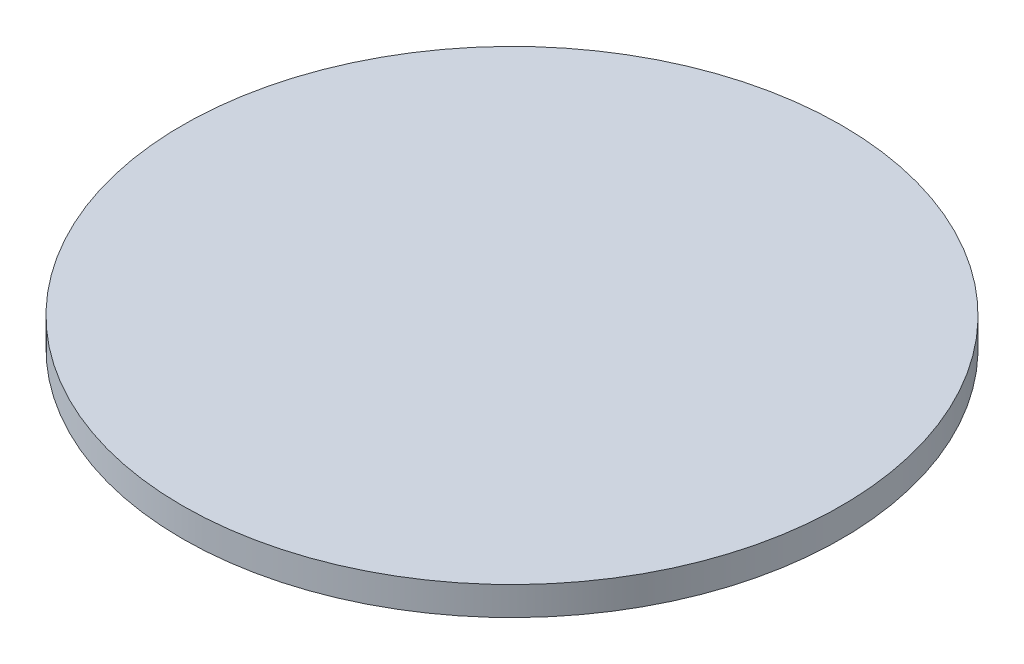
ISO-10303-21;
HEADER;
FILE_DESCRIPTION(('STEP AP214'),'2;1');
FILE_NAME('part.step','',(''),(''),'','','');
FILE_SCHEMA(('AUTOMOTIVE_DESIGN { 1 0 10303 214 1 1 1 1 }'));
ENDSEC;
DATA;
#1=APPLICATION_CONTEXT('core data for automotive mechanical design processes');
#2=APPLICATION_PROTOCOL_DEFINITION('international standard','automotive_design',2000,#1);
#3=PRODUCT_CONTEXT('',#1,'mechanical');
#4=PRODUCT('Part','Part','',(#3));
#5=PRODUCT_RELATED_PRODUCT_CATEGORY('part','',(#4));
#6=PRODUCT_DEFINITION_FORMATION('','',#4);
#7=PRODUCT_DEFINITION_CONTEXT('part definition',#1,'design');
#8=PRODUCT_DEFINITION('design','',#6,#7);
#9=PRODUCT_DEFINITION_SHAPE('','',#8);
#10=(LENGTH_UNIT() NAMED_UNIT(*) SI_UNIT(.MILLI.,.METRE.));
#11=(NAMED_UNIT(*) PLANE_ANGLE_UNIT() SI_UNIT($,.RADIAN.));
#12=(NAMED_UNIT(*) SI_UNIT($,.STERADIAN.) SOLID_ANGLE_UNIT());
#13=UNCERTAINTY_MEASURE_WITH_UNIT(LENGTH_MEASURE(1.E-05),#10,'distance_accuracy_value','');
#14=(GEOMETRIC_REPRESENTATION_CONTEXT(3) GLOBAL_UNCERTAINTY_ASSIGNED_CONTEXT((#13)) GLOBAL_UNIT_ASSIGNED_CONTEXT((#10,
#11,#12)) REPRESENTATION_CONTEXT('',''));
#15=CARTESIAN_POINT('',(0.,0.,0.));
#16=DIRECTION('',(0.,0.,1.));
#17=DIRECTION('',(1.,0.,0.));
#18=AXIS2_PLACEMENT_3D('',#15,#16,#17);
#19=CARTESIAN_POINT('',(0.,1.5875,0.));
#20=DIRECTION('',(0.,-1.,0.));
#21=DIRECTION('',(0.,0.,-1.));
#22=AXIS2_PLACEMENT_3D('',#19,#20,#21);
#23=CYLINDRICAL_SURFACE('',#22,36.576);
#24=CARTESIAN_POINT('',(0.,1.5875,0.));
#25=DIRECTION('',(0.,1.,0.));
#26=DIRECTION('',(0.,0.,1.));
#27=AXIS2_PLACEMENT_3D('',#24,#25,#26);
#28=CIRCLE('',#27,36.576);
#29=CARTESIAN_POINT('',(0.,1.5875,36.576));
#30=VERTEX_POINT('',#29);
#31=EDGE_CURVE('E10',#30,#30,#28,.T.);
#32=ORIENTED_EDGE('',*,*,#31,.F.);
#33=EDGE_LOOP('',(#32));
#34=FACE_BOUND('',#33,.T.);
#35=CARTESIAN_POINT('',(0.,-1.5875,0.));
#36=DIRECTION('',(0.,1.,0.));
#37=DIRECTION('',(0.,0.,1.));
#38=AXIS2_PLACEMENT_3D('',#35,#36,#37);
#39=CIRCLE('',#38,36.576);
#40=CARTESIAN_POINT('',(0.,-1.5875,36.576));
#41=VERTEX_POINT('',#40);
#42=EDGE_CURVE('E38',#41,#41,#39,.T.);
#43=ORIENTED_EDGE('',*,*,#42,.T.);
#44=EDGE_LOOP('',(#43));
#45=FACE_BOUND('',#44,.T.);
#46=ADVANCED_FACE('F35',(#34,#45),#23,.T.);
#47=CARTESIAN_POINT('',(0.,1.5875,0.));
#48=DIRECTION('',(0.,1.,0.));
#49=DIRECTION('',(0.,0.,1.));
#50=AXIS2_PLACEMENT_3D('',#47,#48,#49);
#51=PLANE('',#50);
#52=ORIENTED_EDGE('',*,*,#31,.T.);
#53=EDGE_LOOP('',(#52));
#54=FACE_BOUND('',#53,.T.);
#55=ADVANCED_FACE('F50',(#54),#51,.T.);
#56=CARTESIAN_POINT('',(0.,-1.5875,0.));
#57=DIRECTION('',(0.,1.,0.));
#58=DIRECTION('',(0.,0.,1.));
#59=AXIS2_PLACEMENT_3D('',#56,#57,#58);
#60=PLANE('',#59);
#61=ORIENTED_EDGE('',*,*,#42,.F.);
#62=EDGE_LOOP('',(#61));
#63=FACE_BOUND('',#62,.T.);
#64=ADVANCED_FACE('F48',(#63),#60,.F.);
#65=CLOSED_SHELL('',(#46,#55,#64));
#66=MANIFOLD_SOLID_BREP('B2',#65);
#67=ADVANCED_BREP_SHAPE_REPRESENTATION('',(#18,#66),#14);
#68=SHAPE_DEFINITION_REPRESENTATION(#9,#67);
ENDSEC;
END-ISO-10303-21;
